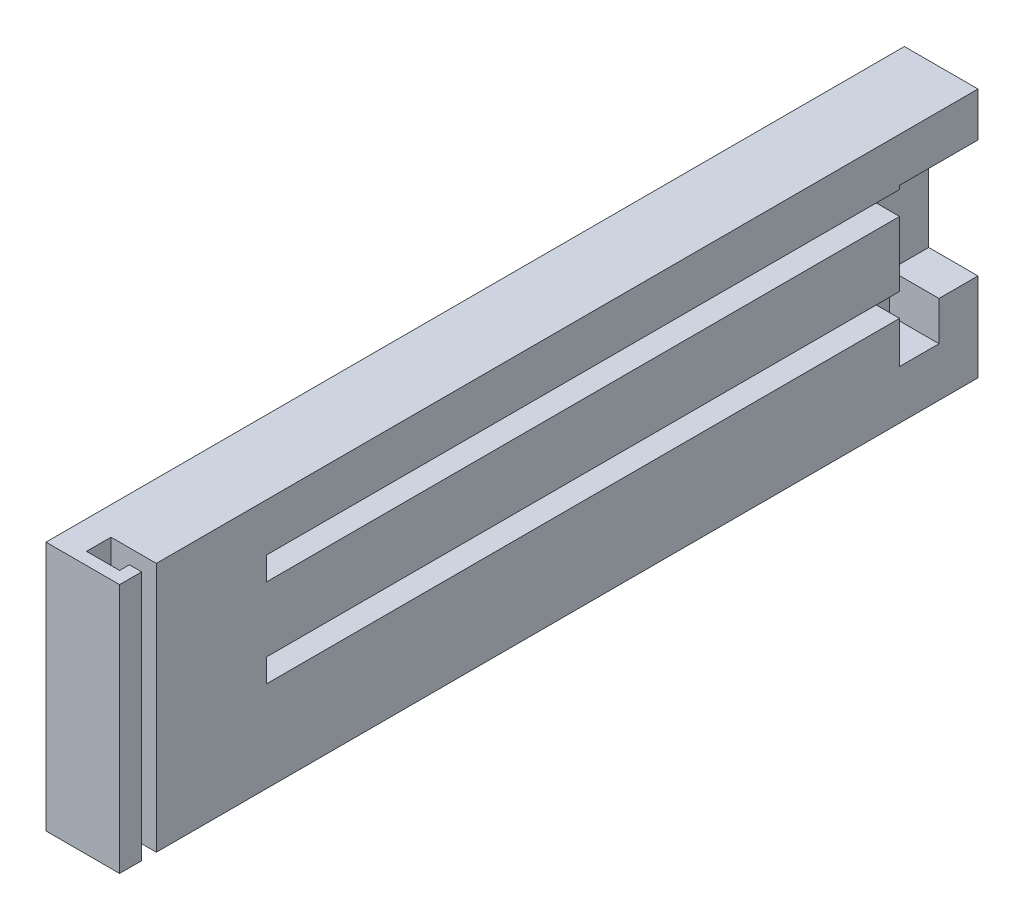
ISO-10303-21;
HEADER;
FILE_DESCRIPTION(('STEP AP214'),'2;1');
FILE_NAME('part.step','',(''),(''),'','','');
FILE_SCHEMA(('AUTOMOTIVE_DESIGN { 1 0 10303 214 1 1 1 1 }'));
ENDSEC;
DATA;
#1=APPLICATION_CONTEXT('core data for automotive mechanical design processes');
#2=APPLICATION_PROTOCOL_DEFINITION('international standard','automotive_design',2000,#1);
#3=PRODUCT_CONTEXT('',#1,'mechanical');
#4=PRODUCT('Part','Part','',(#3));
#5=PRODUCT_RELATED_PRODUCT_CATEGORY('part','',(#4));
#6=PRODUCT_DEFINITION_FORMATION('','',#4);
#7=PRODUCT_DEFINITION_CONTEXT('part definition',#1,'design');
#8=PRODUCT_DEFINITION('design','',#6,#7);
#9=PRODUCT_DEFINITION_SHAPE('','',#8);
#10=(LENGTH_UNIT() NAMED_UNIT(*) SI_UNIT(.MILLI.,.METRE.));
#11=(NAMED_UNIT(*) PLANE_ANGLE_UNIT() SI_UNIT($,.RADIAN.));
#12=(NAMED_UNIT(*) SI_UNIT($,.STERADIAN.) SOLID_ANGLE_UNIT());
#13=UNCERTAINTY_MEASURE_WITH_UNIT(LENGTH_MEASURE(1.E-05),#10,'distance_accuracy_value','');
#14=(GEOMETRIC_REPRESENTATION_CONTEXT(3) GLOBAL_UNCERTAINTY_ASSIGNED_CONTEXT((#13)) GLOBAL_UNIT_ASSIGNED_CONTEXT((#10,
#11,#12)) REPRESENTATION_CONTEXT('',''));
#15=CARTESIAN_POINT('',(0.,0.,0.));
#16=DIRECTION('',(0.,0.,1.));
#17=DIRECTION('',(1.,0.,0.));
#18=AXIS2_PLACEMENT_3D('',#15,#16,#17);
#19=CARTESIAN_POINT('',(15.,0.,0.));
#20=DIRECTION('',(-1.,0.,0.));
#21=DIRECTION('',(0.,0.,1.));
#22=AXIS2_PLACEMENT_3D('',#19,#20,#21);
#23=PLANE('',#22);
#24=DIRECTION('',(0.,0.,-1.));
#25=VECTOR('',#24,1.);
#26=CARTESIAN_POINT('',(15.,-10.4427333974976,-94.4379210779596));
#27=LINE('',#26,#25);
#28=CARTESIAN_POINT('',(15.,-10.4427333974976,-94.4379210779596));
#29=VERTEX_POINT('',#28);
#30=CARTESIAN_POINT('',(15.,-10.4427333974976,-102.48792107796));
#31=VERTEX_POINT('',#30);
#32=EDGE_CURVE('E218',#29,#31,#27,.T.);
#33=ORIENTED_EDGE('',*,*,#32,.F.);
#34=DIRECTION('',(0.,-1.,0.));
#35=VECTOR('',#34,1.);
#36=CARTESIAN_POINT('',(15.,0.,-94.4379210779596));
#37=LINE('',#36,#35);
#38=CARTESIAN_POINT('',(15.,-1.9427333974976,-94.4379210779596));
#39=VERTEX_POINT('',#38);
#40=EDGE_CURVE('E272',#39,#29,#37,.T.);
#41=ORIENTED_EDGE('',*,*,#40,.F.);
#42=DIRECTION('',(0.,0.,-1.));
#43=VECTOR('',#42,1.);
#44=CARTESIAN_POINT('',(15.,-1.94273339749751,34.5620789220404));
#45=LINE('',#44,#43);
#46=CARTESIAN_POINT('',(15.,-1.94273339749751,34.5620789220404));
#47=VERTEX_POINT('',#46);
#48=EDGE_CURVE('E314',#47,#39,#45,.T.);
#49=ORIENTED_EDGE('',*,*,#48,.F.);
#50=DIRECTION('',(0.,-1.,0.));
#51=VECTOR('',#50,1.);
#52=CARTESIAN_POINT('',(15.,0.,34.5620789220404));
#53=LINE('',#52,#51);
#54=CARTESIAN_POINT('',(15.,2.80726660250249,34.5620789220404));
#55=VERTEX_POINT('',#54);
#56=EDGE_CURVE('E309',#55,#47,#53,.T.);
#57=ORIENTED_EDGE('',*,*,#56,.F.);
#58=DIRECTION('',(0.,0.,-1.));
#59=VECTOR('',#58,1.);
#60=CARTESIAN_POINT('',(15.,2.80726660250249,34.5620789220404));
#61=LINE('',#60,#59);
#62=CARTESIAN_POINT('',(15.,2.8072666025024,-94.4379210779596));
#63=VERTEX_POINT('',#62);
#64=EDGE_CURVE('E319',#55,#63,#61,.T.);
#65=ORIENTED_EDGE('',*,*,#64,.T.);
#66=DIRECTION('',(0.,-1.,0.));
#67=VECTOR('',#66,1.);
#68=CARTESIAN_POINT('',(15.,0.,-94.4379210779596));
#69=LINE('',#68,#67);
#70=CARTESIAN_POINT('',(15.,16.0572666025024,-94.4379210779596));
#71=VERTEX_POINT('',#70);
#72=EDGE_CURVE('E261',#71,#63,#69,.T.);
#73=ORIENTED_EDGE('',*,*,#72,.F.);
#74=DIRECTION('',(0.,0.,-1.));
#75=VECTOR('',#74,1.);
#76=CARTESIAN_POINT('',(15.,16.0572666025025,34.5620789220404));
#77=LINE('',#76,#75);
#78=CARTESIAN_POINT('',(15.,16.0572666025025,34.5620789220404));
#79=VERTEX_POINT('',#78);
#80=EDGE_CURVE('E337',#79,#71,#77,.T.);
#81=ORIENTED_EDGE('',*,*,#80,.F.);
#82=DIRECTION('',(0.,1.,0.));
#83=VECTOR('',#82,1.);
#84=CARTESIAN_POINT('',(15.,16.0572666025025,34.5620789220404));
#85=LINE('',#84,#83);
#86=CARTESIAN_POINT('',(15.,20.8072666025025,34.5620789220404));
#87=VERTEX_POINT('',#86);
#88=EDGE_CURVE('E345',#79,#87,#85,.T.);
#89=ORIENTED_EDGE('',*,*,#88,.T.);
#90=DIRECTION('',(0.,0.,-1.));
#91=VECTOR('',#90,1.);
#92=CARTESIAN_POINT('',(15.,20.8072666025025,34.5620789220404));
#93=LINE('',#92,#91);
#94=CARTESIAN_POINT('',(15.,20.8072666025024,-94.4379210779596));
#95=VERTEX_POINT('',#94);
#96=EDGE_CURVE('E341',#87,#95,#93,.T.);
#97=ORIENTED_EDGE('',*,*,#96,.T.);
#98=DIRECTION('',(0.,-1.,0.));
#99=VECTOR('',#98,1.);
#100=CARTESIAN_POINT('',(15.,0.,-94.4379210779596));
#101=LINE('',#100,#99);
#102=CARTESIAN_POINT('',(15.,21.5572666025024,-94.4379210779596));
#103=VERTEX_POINT('',#102);
#104=EDGE_CURVE('E249',#103,#95,#101,.T.);
#105=ORIENTED_EDGE('',*,*,#104,.F.);
#106=DIRECTION('',(0.,0.,-1.));
#107=VECTOR('',#106,1.);
#108=CARTESIAN_POINT('',(15.,21.5572666025024,-94.4379210779596));
#109=LINE('',#108,#107);
#110=CARTESIAN_POINT('',(15.,21.5572666025024,-110.43792107796));
#111=VERTEX_POINT('',#110);
#112=EDGE_CURVE('E292',#103,#111,#109,.T.);
#113=ORIENTED_EDGE('',*,*,#112,.T.);
#114=DIRECTION('',(0.,-1.,0.));
#115=VECTOR('',#114,1.);
#116=CARTESIAN_POINT('',(15.,30.5572666025024,-110.43792107796));
#117=LINE('',#116,#115);
#118=CARTESIAN_POINT('',(15.,30.5572666025024,-110.43792107796));
#119=VERTEX_POINT('',#118);
#120=EDGE_CURVE('E421',#119,#111,#117,.T.);
#121=ORIENTED_EDGE('',*,*,#120,.F.);
#122=DIRECTION('',(0.,0.,-1.));
#123=VECTOR('',#122,1.);
#124=CARTESIAN_POINT('',(15.,30.5572666025024,64.5620789220404));
#125=LINE('',#124,#123);
#126=CARTESIAN_POINT('',(15.,30.5572666025024,57.0620789220404));
#127=VERTEX_POINT('',#126);
#128=EDGE_CURVE('E420',#127,#119,#125,.T.);
#129=ORIENTED_EDGE('',*,*,#128,.F.);
#130=DIRECTION('',(0.,1.,0.));
#131=VECTOR('',#130,1.);
#132=CARTESIAN_POINT('',(15.,-20.4427333974976,57.0620789220404));
#133=LINE('',#132,#131);
#134=CARTESIAN_POINT('',(15.,-20.4427333974976,57.0620789220404));
#135=VERTEX_POINT('',#134);
#136=EDGE_CURVE('E407',#135,#127,#133,.T.);
#137=ORIENTED_EDGE('',*,*,#136,.F.);
#138=DIRECTION('',(0.,0.,-1.));
#139=VECTOR('',#138,1.);
#140=CARTESIAN_POINT('',(15.,-20.4427333974976,64.5620789220404));
#141=LINE('',#140,#139);
#142=CARTESIAN_POINT('',(15.,-20.4427333974976,-110.43792107796));
#143=VERTEX_POINT('',#142);
#144=EDGE_CURVE('E425',#135,#143,#141,.T.);
#145=ORIENTED_EDGE('',*,*,#144,.T.);
#146=CARTESIAN_POINT('',(15.,-2.4427333974976,-110.43792107796));
#147=VERTEX_POINT('',#146);
#148=EDGE_CURVE('E419',#147,#143,#117,.T.);
#149=ORIENTED_EDGE('',*,*,#148,.F.);
#150=DIRECTION('',(0.,0.,-1.));
#151=VECTOR('',#150,1.);
#152=CARTESIAN_POINT('',(15.,-2.4427333974976,-94.4379210779596));
#153=LINE('',#152,#151);
#154=CARTESIAN_POINT('',(15.,-2.4427333974976,-102.48792107796));
#155=VERTEX_POINT('',#154);
#156=EDGE_CURVE('E232',#155,#147,#153,.T.);
#157=ORIENTED_EDGE('',*,*,#156,.F.);
#158=DIRECTION('',(0.,1.,0.));
#159=VECTOR('',#158,1.);
#160=CARTESIAN_POINT('',(15.,-10.4427333974976,-102.48792107796));
#161=LINE('',#160,#159);
#162=EDGE_CURVE('E210',#31,#155,#161,.T.);
#163=ORIENTED_EDGE('',*,*,#162,.F.);
#164=EDGE_LOOP('',(#33,#41,#49,#57,#65,#73,#81,#89,#97,#105,#113,#121,#129,#137,#145,#149,#157,#163));
#165=FACE_BOUND('',#164,.T.);
#166=ADVANCED_FACE('F43',(#165),#23,.F.);
#167=CARTESIAN_POINT('',(15.,20.8072666025025,34.5620789220404));
#168=DIRECTION('',(0.,-1.,0.));
#169=DIRECTION('',(0.,0.,-1.));
#170=AXIS2_PLACEMENT_3D('',#167,#168,#169);
#171=PLANE('',#170);
#172=DIRECTION('',(0.,0.,-1.));
#173=VECTOR('',#172,1.);
#174=CARTESIAN_POINT('',(10.25,20.8072666025025,34.5620789220404));
#175=LINE('',#174,#173);
#176=CARTESIAN_POINT('',(10.25,20.8072666025025,34.5620789220404));
#177=VERTEX_POINT('',#176);
#178=CARTESIAN_POINT('',(10.25,20.8072666025024,-94.4379210779596));
#179=VERTEX_POINT('',#178);
#180=EDGE_CURVE('E289',#177,#179,#175,.T.);
#181=ORIENTED_EDGE('',*,*,#180,.T.);
#182=DIRECTION('',(-1.,0.,0.));
#183=VECTOR('',#182,1.);
#184=CARTESIAN_POINT('',(0.,20.8072666025024,-94.4379210779596));
#185=LINE('',#184,#183);
#186=EDGE_CURVE('E252',#95,#179,#185,.T.);
#187=ORIENTED_EDGE('',*,*,#186,.F.);
#188=ORIENTED_EDGE('',*,*,#96,.F.);
#189=DIRECTION('',(-1.,0.,0.));
#190=VECTOR('',#189,1.);
#191=CARTESIAN_POINT('',(15.,20.8072666025025,34.5620789220404));
#192=LINE('',#191,#190);
#193=EDGE_CURVE('E302',#87,#177,#192,.T.);
#194=ORIENTED_EDGE('',*,*,#193,.T.);
#195=EDGE_LOOP('',(#181,#187,#188,#194));
#196=FACE_BOUND('',#195,.T.);
#197=ADVANCED_FACE('F509',(#196),#171,.T.);
#198=CARTESIAN_POINT('',(10.25,16.0572666025025,34.5620789220404));
#199=DIRECTION('',(-1.,0.,0.));
#200=DIRECTION('',(0.,0.,1.));
#201=AXIS2_PLACEMENT_3D('',#198,#199,#200);
#202=PLANE('',#201);
#203=DIRECTION('',(0.,-1.,0.));
#204=VECTOR('',#203,1.);
#205=CARTESIAN_POINT('',(10.25,0.,-94.4379210779596));
#206=LINE('',#205,#204);
#207=CARTESIAN_POINT('',(10.25,16.0572666025024,-94.4379210779596));
#208=VERTEX_POINT('',#207);
#209=EDGE_CURVE('E255',#179,#208,#206,.T.);
#210=ORIENTED_EDGE('',*,*,#209,.F.);
#211=ORIENTED_EDGE('',*,*,#180,.F.);
#212=DIRECTION('',(0.,1.,0.));
#213=VECTOR('',#212,1.);
#214=CARTESIAN_POINT('',(10.25,16.0572666025025,34.5620789220404));
#215=LINE('',#214,#213);
#216=CARTESIAN_POINT('',(10.25,16.0572666025025,34.5620789220404));
#217=VERTEX_POINT('',#216);
#218=EDGE_CURVE('E353',#217,#177,#215,.T.);
#219=ORIENTED_EDGE('',*,*,#218,.F.);
#220=DIRECTION('',(0.,0.,-1.));
#221=VECTOR('',#220,1.);
#222=CARTESIAN_POINT('',(10.25,16.0572666025025,34.5620789220404));
#223=LINE('',#222,#221);
#224=EDGE_CURVE('E333',#217,#208,#223,.T.);
#225=ORIENTED_EDGE('',*,*,#224,.T.);
#226=EDGE_LOOP('',(#210,#211,#219,#225));
#227=FACE_BOUND('',#226,.T.);
#228=ADVANCED_FACE('F514',(#227),#202,.F.);
#229=CARTESIAN_POINT('',(15.,16.0572666025025,34.5620789220404));
#230=DIRECTION('',(0.,-1.,0.));
#231=DIRECTION('',(0.,0.,-1.));
#232=AXIS2_PLACEMENT_3D('',#229,#230,#231);
#233=PLANE('',#232);
#234=DIRECTION('',(1.,0.,0.));
#235=VECTOR('',#234,1.);
#236=CARTESIAN_POINT('',(0.,16.0572666025024,-94.4379210779596));
#237=LINE('',#236,#235);
#238=EDGE_CURVE('E258',#208,#71,#237,.T.);
#239=ORIENTED_EDGE('',*,*,#238,.F.);
#240=ORIENTED_EDGE('',*,*,#224,.F.);
#241=DIRECTION('',(-1.,0.,0.));
#242=VECTOR('',#241,1.);
#243=CARTESIAN_POINT('',(15.,16.0572666025025,34.5620789220404));
#244=LINE('',#243,#242);
#245=EDGE_CURVE('E349',#79,#217,#244,.T.);
#246=ORIENTED_EDGE('',*,*,#245,.F.);
#247=ORIENTED_EDGE('',*,*,#80,.T.);
#248=EDGE_LOOP('',(#239,#240,#246,#247));
#249=FACE_BOUND('',#248,.T.);
#250=ADVANCED_FACE('F547',(#249),#233,.F.);
#251=CARTESIAN_POINT('',(0.,-1.94273339749751,34.5620789220404));
#252=DIRECTION('',(0.,1.,0.));
#253=DIRECTION('',(0.,0.,1.));
#254=AXIS2_PLACEMENT_3D('',#251,#252,#253);
#255=PLANE('',#254);
#256=ORIENTED_EDGE('',*,*,#48,.T.);
#257=DIRECTION('',(1.,0.,0.));
#258=VECTOR('',#257,1.);
#259=CARTESIAN_POINT('',(0.,-1.9427333974976,-94.4379210779596));
#260=LINE('',#259,#258);
#261=CARTESIAN_POINT('',(10.25,-1.9427333974976,-94.4379210779596));
#262=VERTEX_POINT('',#261);
#263=EDGE_CURVE('E269',#262,#39,#260,.T.);
#264=ORIENTED_EDGE('',*,*,#263,.F.);
#265=DIRECTION('',(0.,0.,-1.));
#266=VECTOR('',#265,1.);
#267=CARTESIAN_POINT('',(10.25,-1.94273339749751,34.5620789220404));
#268=LINE('',#267,#266);
#269=CARTESIAN_POINT('',(10.25,-1.94273339749751,34.5620789220404));
#270=VERTEX_POINT('',#269);
#271=EDGE_CURVE('E313',#270,#262,#268,.T.);
#272=ORIENTED_EDGE('',*,*,#271,.F.);
#273=DIRECTION('',(1.,0.,0.));
#274=VECTOR('',#273,1.);
#275=CARTESIAN_POINT('',(0.,-1.94273339749751,34.5620789220404));
#276=LINE('',#275,#274);
#277=EDGE_CURVE('E298',#270,#47,#276,.T.);
#278=ORIENTED_EDGE('',*,*,#277,.T.);
#279=EDGE_LOOP('',(#256,#264,#272,#278));
#280=FACE_BOUND('',#279,.T.);
#281=ADVANCED_FACE('F541',(#280),#255,.T.);
#282=CARTESIAN_POINT('',(0.,2.80726660250249,34.5620789220404));
#283=DIRECTION('',(0.,1.,0.));
#284=DIRECTION('',(0.,0.,1.));
#285=AXIS2_PLACEMENT_3D('',#282,#283,#284);
#286=PLANE('',#285);
#287=DIRECTION('',(-1.,0.,0.));
#288=VECTOR('',#287,1.);
#289=CARTESIAN_POINT('',(0.,2.8072666025024,-94.4379210779596));
#290=LINE('',#289,#288);
#291=CARTESIAN_POINT('',(10.25,2.80726660250241,-94.4379210779596));
#292=VERTEX_POINT('',#291);
#293=EDGE_CURVE('E61',#63,#292,#290,.T.);
#294=ORIENTED_EDGE('',*,*,#293,.F.);
#295=ORIENTED_EDGE('',*,*,#64,.F.);
#296=DIRECTION('',(1.,0.,0.));
#297=VECTOR('',#296,1.);
#298=CARTESIAN_POINT('',(0.,2.80726660250249,34.5620789220404));
#299=LINE('',#298,#297);
#300=CARTESIAN_POINT('',(10.25,2.80726660250249,34.5620789220404));
#301=VERTEX_POINT('',#300);
#302=EDGE_CURVE('E305',#301,#55,#299,.T.);
#303=ORIENTED_EDGE('',*,*,#302,.F.);
#304=DIRECTION('',(0.,0.,-1.));
#305=VECTOR('',#304,1.);
#306=CARTESIAN_POINT('',(10.25,2.80726660250249,34.5620789220404));
#307=LINE('',#306,#305);
#308=EDGE_CURVE('E323',#301,#292,#307,.T.);
#309=ORIENTED_EDGE('',*,*,#308,.T.);
#310=EDGE_LOOP('',(#294,#295,#303,#309));
#311=FACE_BOUND('',#310,.T.);
#312=ADVANCED_FACE('F535',(#311),#286,.F.);
#313=CARTESIAN_POINT('',(10.25,0.,34.5620789220404));
#314=DIRECTION('',(1.,0.,0.));
#315=DIRECTION('',(0.,0.,-1.));
#316=AXIS2_PLACEMENT_3D('',#313,#314,#315);
#317=PLANE('',#316);
#318=ORIENTED_EDGE('',*,*,#271,.T.);
#319=DIRECTION('',(0.,-1.,0.));
#320=VECTOR('',#319,1.);
#321=CARTESIAN_POINT('',(10.25,0.,-94.4379210779596));
#322=LINE('',#321,#320);
#323=EDGE_CURVE('E266',#292,#262,#322,.T.);
#324=ORIENTED_EDGE('',*,*,#323,.F.);
#325=ORIENTED_EDGE('',*,*,#308,.F.);
#326=DIRECTION('',(0.,-1.,0.));
#327=VECTOR('',#326,1.);
#328=CARTESIAN_POINT('',(10.25,0.,34.5620789220404));
#329=LINE('',#328,#327);
#330=EDGE_CURVE('E301',#301,#270,#329,.T.);
#331=ORIENTED_EDGE('',*,*,#330,.T.);
#332=EDGE_LOOP('',(#318,#324,#325,#331));
#333=FACE_BOUND('',#332,.T.);
#334=ADVANCED_FACE('F530',(#333),#317,.T.);
#335=CARTESIAN_POINT('',(15.,30.5572666025024,-110.43792107796));
#336=DIRECTION('',(0.,0.,-1.));
#337=DIRECTION('',(-1.,0.,0.));
#338=AXIS2_PLACEMENT_3D('',#335,#336,#337);
#339=PLANE('',#338);
#340=DIRECTION('',(-1.,0.,0.));
#341=VECTOR('',#340,1.);
#342=CARTESIAN_POINT('',(0.,-2.44273339749761,-110.43792107796));
#343=LINE('',#342,#341);
#344=CARTESIAN_POINT('',(4.95,-2.4427333974976,-110.43792107796));
#345=VERTEX_POINT('',#344);
#346=EDGE_CURVE('E246',#147,#345,#343,.T.);
#347=ORIENTED_EDGE('',*,*,#346,.F.);
#348=ORIENTED_EDGE('',*,*,#148,.T.);
#349=DIRECTION('',(-1.,0.,0.));
#350=VECTOR('',#349,1.);
#351=CARTESIAN_POINT('',(15.,-20.4427333974976,-110.43792107796));
#352=LINE('',#351,#350);
#353=CARTESIAN_POINT('',(0.,-20.4427333974976,-110.43792107796));
#354=VERTEX_POINT('',#353);
#355=EDGE_CURVE('E449',#143,#354,#352,.T.);
#356=ORIENTED_EDGE('',*,*,#355,.T.);
#357=DIRECTION('',(0.,-1.,0.));
#358=VECTOR('',#357,1.);
#359=CARTESIAN_POINT('',(0.,30.5572666025024,-110.43792107796));
#360=LINE('',#359,#358);
#361=CARTESIAN_POINT('',(0.,30.5572666025024,-110.43792107796));
#362=VERTEX_POINT('',#361);
#363=EDGE_CURVE('E436',#362,#354,#360,.T.);
#364=ORIENTED_EDGE('',*,*,#363,.F.);
#365=DIRECTION('',(-1.,0.,0.));
#366=VECTOR('',#365,1.);
#367=CARTESIAN_POINT('',(15.,30.5572666025024,-110.43792107796));
#368=LINE('',#367,#366);
#369=EDGE_CURVE('E47',#119,#362,#368,.T.);
#370=ORIENTED_EDGE('',*,*,#369,.F.);
#371=ORIENTED_EDGE('',*,*,#120,.T.);
#372=DIRECTION('',(-1.,0.,0.));
#373=VECTOR('',#372,1.);
#374=CARTESIAN_POINT('',(0.,21.5572666025024,-110.43792107796));
#375=LINE('',#374,#373);
#376=CARTESIAN_POINT('',(4.95,21.5572666025024,-110.43792107796));
#377=VERTEX_POINT('',#376);
#378=EDGE_CURVE('E279',#111,#377,#375,.T.);
#379=ORIENTED_EDGE('',*,*,#378,.T.);
#380=DIRECTION('',(0.,-1.,0.));
#381=VECTOR('',#380,1.);
#382=CARTESIAN_POINT('',(4.95,0.,-110.43792107796));
#383=LINE('',#382,#381);
#384=EDGE_CURVE('E237',#377,#345,#383,.T.);
#385=ORIENTED_EDGE('',*,*,#384,.T.);
#386=EDGE_LOOP('',(#347,#348,#356,#364,#370,#371,#379,#385));
#387=FACE_BOUND('',#386,.T.);
#388=ADVANCED_FACE('F462',(#387),#339,.T.);
#389=CARTESIAN_POINT('',(15.,30.5572666025024,64.5620789220404));
#390=DIRECTION('',(0.,1.,0.));
#391=DIRECTION('',(0.,0.,1.));
#392=AXIS2_PLACEMENT_3D('',#389,#390,#391);
#393=PLANE('',#392);
#394=DIRECTION('',(-1.,0.,0.));
#395=VECTOR('',#394,1.);
#396=CARTESIAN_POINT('',(0.,30.5572666025024,57.0620789220404));
#397=LINE('',#396,#395);
#398=CARTESIAN_POINT('',(5.75,30.5572666025024,57.0620789220404));
#399=VERTEX_POINT('',#398);
#400=EDGE_CURVE('E386',#127,#399,#397,.T.);
#401=ORIENTED_EDGE('',*,*,#400,.F.);
#402=ORIENTED_EDGE('',*,*,#128,.T.);
#403=ORIENTED_EDGE('',*,*,#369,.T.);
#404=DIRECTION('',(0.,0.,-1.));
#405=VECTOR('',#404,1.);
#406=CARTESIAN_POINT('',(0.,30.5572666025024,64.5620789220404));
#407=LINE('',#406,#405);
#408=CARTESIAN_POINT('',(0.,30.5572666025024,64.5620789220404));
#409=VERTEX_POINT('',#408);
#410=EDGE_CURVE('E400',#409,#362,#407,.T.);
#411=ORIENTED_EDGE('',*,*,#410,.F.);
#412=DIRECTION('',(-1.,0.,0.));
#413=VECTOR('',#412,1.);
#414=CARTESIAN_POINT('',(15.,30.5572666025024,64.5620789220404));
#415=LINE('',#414,#413);
#416=CARTESIAN_POINT('',(15.,30.5572666025024,64.5620789220404));
#417=VERTEX_POINT('',#416);
#418=EDGE_CURVE('E11',#417,#409,#415,.T.);
#419=ORIENTED_EDGE('',*,*,#418,.F.);
#420=CARTESIAN_POINT('',(15.,30.5572666025024,60.0620789220404));
#421=VERTEX_POINT('',#420);
#422=EDGE_CURVE('E415',#417,#421,#125,.T.);
#423=ORIENTED_EDGE('',*,*,#422,.T.);
#424=DIRECTION('',(1.,0.,0.));
#425=VECTOR('',#424,1.);
#426=CARTESIAN_POINT('',(0.,30.5572666025024,60.0620789220404));
#427=LINE('',#426,#425);
#428=CARTESIAN_POINT('',(12.5,30.5572666025024,60.0620789220404));
#429=VERTEX_POINT('',#428);
#430=EDGE_CURVE('E69',#429,#421,#427,.T.);
#431=ORIENTED_EDGE('',*,*,#430,.F.);
#432=DIRECTION('',(0.,0.,-1.));
#433=VECTOR('',#432,1.);
#434=CARTESIAN_POINT('',(12.5,30.5572666025024,0.));
#435=LINE('',#434,#433);
#436=CARTESIAN_POINT('',(12.5,30.5572666025024,62.0620789220404));
#437=VERTEX_POINT('',#436);
#438=EDGE_CURVE('E318',#437,#429,#435,.T.);
#439=ORIENTED_EDGE('',*,*,#438,.F.);
#440=DIRECTION('',(1.,0.,0.));
#441=VECTOR('',#440,1.);
#442=CARTESIAN_POINT('',(0.,30.5572666025024,62.0620789220404));
#443=LINE('',#442,#441);
#444=CARTESIAN_POINT('',(5.75,30.5572666025024,62.0620789220404));
#445=VERTEX_POINT('',#444);
#446=EDGE_CURVE('E364',#445,#437,#443,.T.);
#447=ORIENTED_EDGE('',*,*,#446,.F.);
#448=DIRECTION('',(0.,0.,1.));
#449=VECTOR('',#448,1.);
#450=CARTESIAN_POINT('',(5.75,30.5572666025024,0.));
#451=LINE('',#450,#449);
#452=EDGE_CURVE('E390',#399,#445,#451,.T.);
#453=ORIENTED_EDGE('',*,*,#452,.F.);
#454=EDGE_LOOP('',(#401,#402,#403,#411,#419,#423,#431,#439,#447,#453));
#455=FACE_BOUND('',#454,.T.);
#456=ADVANCED_FACE('F45',(#455),#393,.T.);
#457=CARTESIAN_POINT('',(15.,30.5572666025024,64.5620789220404));
#458=DIRECTION('',(0.,0.,-1.));
#459=DIRECTION('',(-1.,0.,0.));
#460=AXIS2_PLACEMENT_3D('',#457,#458,#459);
#461=PLANE('',#460);
#462=DIRECTION('',(0.,-1.,0.));
#463=VECTOR('',#462,1.);
#464=CARTESIAN_POINT('',(0.,30.5572666025024,64.5620789220404));
#465=LINE('',#464,#463);
#466=CARTESIAN_POINT('',(0.,-20.4427333974976,64.5620789220404));
#467=VERTEX_POINT('',#466);
#468=EDGE_CURVE('E444',#409,#467,#465,.T.);
#469=ORIENTED_EDGE('',*,*,#468,.T.);
#470=DIRECTION('',(-1.,0.,0.));
#471=VECTOR('',#470,1.);
#472=CARTESIAN_POINT('',(15.,-20.4427333974976,64.5620789220404));
#473=LINE('',#472,#471);
#474=CARTESIAN_POINT('',(15.,-20.4427333974976,64.5620789220404));
#475=VERTEX_POINT('',#474);
#476=EDGE_CURVE('E53',#475,#467,#473,.T.);
#477=ORIENTED_EDGE('',*,*,#476,.F.);
#478=DIRECTION('',(0.,-1.,0.));
#479=VECTOR('',#478,1.);
#480=CARTESIAN_POINT('',(15.,30.5572666025024,64.5620789220404));
#481=LINE('',#480,#479);
#482=EDGE_CURVE('E430',#417,#475,#481,.T.);
#483=ORIENTED_EDGE('',*,*,#482,.F.);
#484=ORIENTED_EDGE('',*,*,#418,.T.);
#485=EDGE_LOOP('',(#469,#477,#483,#484));
#486=FACE_BOUND('',#485,.T.);
#487=ADVANCED_FACE('F469',(#486),#461,.F.);
#488=CARTESIAN_POINT('',(15.,-20.4427333974976,64.5620789220404));
#489=DIRECTION('',(0.,1.,0.));
#490=DIRECTION('',(0.,0.,1.));
#491=AXIS2_PLACEMENT_3D('',#488,#489,#490);
#492=PLANE('',#491);
#493=ORIENTED_EDGE('',*,*,#144,.F.);
#494=DIRECTION('',(-1.,0.,0.));
#495=VECTOR('',#494,1.);
#496=CARTESIAN_POINT('',(0.,-20.4427333974976,57.0620789220404));
#497=LINE('',#496,#495);
#498=CARTESIAN_POINT('',(5.75,-20.4427333974976,57.0620789220404));
#499=VERTEX_POINT('',#498);
#500=EDGE_CURVE('E368',#135,#499,#497,.T.);
#501=ORIENTED_EDGE('',*,*,#500,.T.);
#502=DIRECTION('',(0.,0.,1.));
#503=VECTOR('',#502,1.);
#504=CARTESIAN_POINT('',(5.75,-20.4427333974976,0.));
#505=LINE('',#504,#503);
#506=CARTESIAN_POINT('',(5.75,-20.4427333974976,62.0620789220404));
#507=VERTEX_POINT('',#506);
#508=EDGE_CURVE('E372',#499,#507,#505,.T.);
#509=ORIENTED_EDGE('',*,*,#508,.T.);
#510=DIRECTION('',(1.,0.,0.));
#511=VECTOR('',#510,1.);
#512=CARTESIAN_POINT('',(0.,-20.4427333974976,62.0620789220404));
#513=LINE('',#512,#511);
#514=CARTESIAN_POINT('',(12.5,-20.4427333974976,62.0620789220404));
#515=VERTEX_POINT('',#514);
#516=EDGE_CURVE('E376',#507,#515,#513,.T.);
#517=ORIENTED_EDGE('',*,*,#516,.T.);
#518=DIRECTION('',(0.,0.,-1.));
#519=VECTOR('',#518,1.);
#520=CARTESIAN_POINT('',(12.5,-20.4427333974976,0.));
#521=LINE('',#520,#519);
#522=CARTESIAN_POINT('',(12.5,-20.4427333974976,60.0620789220404));
#523=VERTEX_POINT('',#522);
#524=EDGE_CURVE('E359',#515,#523,#521,.T.);
#525=ORIENTED_EDGE('',*,*,#524,.T.);
#526=DIRECTION('',(1.,0.,0.));
#527=VECTOR('',#526,1.);
#528=CARTESIAN_POINT('',(0.,-20.4427333974976,60.0620789220404));
#529=LINE('',#528,#527);
#530=CARTESIAN_POINT('',(15.,-20.4427333974976,60.0620789220404));
#531=VERTEX_POINT('',#530);
#532=EDGE_CURVE('E363',#523,#531,#529,.T.);
#533=ORIENTED_EDGE('',*,*,#532,.T.);
#534=EDGE_CURVE('E426',#475,#531,#141,.T.);
#535=ORIENTED_EDGE('',*,*,#534,.F.);
#536=ORIENTED_EDGE('',*,*,#476,.T.);
#537=DIRECTION('',(0.,0.,-1.));
#538=VECTOR('',#537,1.);
#539=CARTESIAN_POINT('',(0.,-20.4427333974976,64.5620789220404));
#540=LINE('',#539,#538);
#541=EDGE_CURVE('E440',#467,#354,#540,.T.);
#542=ORIENTED_EDGE('',*,*,#541,.T.);
#543=ORIENTED_EDGE('',*,*,#355,.F.);
#544=EDGE_LOOP('',(#493,#501,#509,#517,#525,#533,#535,#536,#542,#543));
#545=FACE_BOUND('',#544,.T.);
#546=ADVANCED_FACE('F474',(#545),#492,.F.);
#547=ORIENTED_EDGE('',*,*,#534,.T.);
#548=DIRECTION('',(0.,1.,0.));
#549=VECTOR('',#548,1.);
#550=CARTESIAN_POINT('',(15.,-20.4427333974976,60.0620789220404));
#551=LINE('',#550,#549);
#552=EDGE_CURVE('E410',#531,#421,#551,.T.);
#553=ORIENTED_EDGE('',*,*,#552,.T.);
#554=ORIENTED_EDGE('',*,*,#422,.F.);
#555=ORIENTED_EDGE('',*,*,#482,.T.);
#556=EDGE_LOOP('',(#547,#553,#554,#555));
#557=FACE_BOUND('',#556,.T.);
#558=ADVANCED_FACE('F477',(#557),#23,.F.);
#559=CARTESIAN_POINT('',(0.,0.,0.));
#560=DIRECTION('',(-1.,0.,0.));
#561=DIRECTION('',(0.,0.,1.));
#562=AXIS2_PLACEMENT_3D('',#559,#560,#561);
#563=PLANE('',#562);
#564=ORIENTED_EDGE('',*,*,#410,.T.);
#565=ORIENTED_EDGE('',*,*,#363,.T.);
#566=ORIENTED_EDGE('',*,*,#541,.F.);
#567=ORIENTED_EDGE('',*,*,#468,.F.);
#568=EDGE_LOOP('',(#564,#565,#566,#567));
#569=FACE_BOUND('',#568,.T.);
#570=ADVANCED_FACE('F466',(#569),#563,.T.);
#571=CARTESIAN_POINT('',(12.5,-20.4427333974976,0.));
#572=DIRECTION('',(1.,0.,0.));
#573=DIRECTION('',(0.,0.,-1.));
#574=AXIS2_PLACEMENT_3D('',#571,#572,#573);
#575=PLANE('',#574);
#576=ORIENTED_EDGE('',*,*,#438,.T.);
#577=DIRECTION('',(0.,1.,0.));
#578=VECTOR('',#577,1.);
#579=CARTESIAN_POINT('',(12.5,-20.4427333974976,60.0620789220404));
#580=LINE('',#579,#578);
#581=EDGE_CURVE('E380',#523,#429,#580,.T.);
#582=ORIENTED_EDGE('',*,*,#581,.F.);
#583=ORIENTED_EDGE('',*,*,#524,.F.);
#584=DIRECTION('',(0.,1.,0.));
#585=VECTOR('',#584,1.);
#586=CARTESIAN_POINT('',(12.5,-20.4427333974976,62.0620789220404));
#587=LINE('',#586,#585);
#588=EDGE_CURVE('E397',#515,#437,#587,.T.);
#589=ORIENTED_EDGE('',*,*,#588,.T.);
#590=EDGE_LOOP('',(#576,#582,#583,#589));
#591=FACE_BOUND('',#590,.T.);
#592=ADVANCED_FACE('F483',(#591),#575,.F.);
#593=CARTESIAN_POINT('',(0.,-20.4427333974976,62.0620789220404));
#594=DIRECTION('',(0.,0.,1.));
#595=DIRECTION('',(1.,0.,0.));
#596=AXIS2_PLACEMENT_3D('',#593,#594,#595);
#597=PLANE('',#596);
#598=ORIENTED_EDGE('',*,*,#446,.T.);
#599=ORIENTED_EDGE('',*,*,#588,.F.);
#600=ORIENTED_EDGE('',*,*,#516,.F.);
#601=DIRECTION('',(0.,1.,0.));
#602=VECTOR('',#601,1.);
#603=CARTESIAN_POINT('',(5.75,-20.4427333974976,62.0620789220404));
#604=LINE('',#603,#602);
#605=EDGE_CURVE('E401',#507,#445,#604,.T.);
#606=ORIENTED_EDGE('',*,*,#605,.T.);
#607=EDGE_LOOP('',(#598,#599,#600,#606));
#608=FACE_BOUND('',#607,.T.);
#609=ADVANCED_FACE('F487',(#608),#597,.F.);
#610=CARTESIAN_POINT('',(5.75,-20.4427333974976,0.));
#611=DIRECTION('',(-1.,0.,0.));
#612=DIRECTION('',(0.,0.,1.));
#613=AXIS2_PLACEMENT_3D('',#610,#611,#612);
#614=PLANE('',#613);
#615=ORIENTED_EDGE('',*,*,#452,.T.);
#616=ORIENTED_EDGE('',*,*,#605,.F.);
#617=ORIENTED_EDGE('',*,*,#508,.F.);
#618=DIRECTION('',(0.,1.,0.));
#619=VECTOR('',#618,1.);
#620=CARTESIAN_POINT('',(5.75,-20.4427333974976,57.0620789220404));
#621=LINE('',#620,#619);
#622=EDGE_CURVE('E404',#499,#399,#621,.T.);
#623=ORIENTED_EDGE('',*,*,#622,.T.);
#624=EDGE_LOOP('',(#615,#616,#617,#623));
#625=FACE_BOUND('',#624,.T.);
#626=ADVANCED_FACE('F490',(#625),#614,.F.);
#627=CARTESIAN_POINT('',(0.,-20.4427333974976,57.0620789220404));
#628=DIRECTION('',(0.,0.,-1.));
#629=DIRECTION('',(-1.,0.,0.));
#630=AXIS2_PLACEMENT_3D('',#627,#628,#629);
#631=PLANE('',#630);
#632=ORIENTED_EDGE('',*,*,#400,.T.);
#633=ORIENTED_EDGE('',*,*,#622,.F.);
#634=ORIENTED_EDGE('',*,*,#500,.F.);
#635=ORIENTED_EDGE('',*,*,#136,.T.);
#636=EDGE_LOOP('',(#632,#633,#634,#635));
#637=FACE_BOUND('',#636,.T.);
#638=ADVANCED_FACE('F497',(#637),#631,.F.);
#639=CARTESIAN_POINT('',(0.,-20.4427333974976,60.0620789220404));
#640=DIRECTION('',(0.,0.,1.));
#641=DIRECTION('',(1.,0.,0.));
#642=AXIS2_PLACEMENT_3D('',#639,#640,#641);
#643=PLANE('',#642);
#644=ORIENTED_EDGE('',*,*,#430,.T.);
#645=ORIENTED_EDGE('',*,*,#552,.F.);
#646=ORIENTED_EDGE('',*,*,#532,.F.);
#647=ORIENTED_EDGE('',*,*,#581,.T.);
#648=EDGE_LOOP('',(#644,#645,#646,#647));
#649=FACE_BOUND('',#648,.T.);
#650=ADVANCED_FACE('F499',(#649),#643,.F.);
#651=CARTESIAN_POINT('',(0.,0.,34.5620789220404));
#652=DIRECTION('',(0.,0.,-1.));
#653=DIRECTION('',(-1.,0.,0.));
#654=AXIS2_PLACEMENT_3D('',#651,#652,#653);
#655=PLANE('',#654);
#656=ORIENTED_EDGE('',*,*,#193,.F.);
#657=ORIENTED_EDGE('',*,*,#88,.F.);
#658=ORIENTED_EDGE('',*,*,#245,.T.);
#659=ORIENTED_EDGE('',*,*,#218,.T.);
#660=EDGE_LOOP('',(#656,#657,#658,#659));
#661=FACE_BOUND('',#660,.T.);
#662=ADVANCED_FACE('F505',(#661),#655,.T.);
#663=CARTESIAN_POINT('',(0.,0.,34.5620789220404));
#664=DIRECTION('',(0.,0.,-1.));
#665=DIRECTION('',(0.,1.,0.));
#666=AXIS2_PLACEMENT_3D('',#663,#664,#665);
#667=PLANE('',#666);
#668=ORIENTED_EDGE('',*,*,#277,.F.);
#669=ORIENTED_EDGE('',*,*,#330,.F.);
#670=ORIENTED_EDGE('',*,*,#302,.T.);
#671=ORIENTED_EDGE('',*,*,#56,.T.);
#672=EDGE_LOOP('',(#668,#669,#670,#671));
#673=FACE_BOUND('',#672,.T.);
#674=ADVANCED_FACE('F558',(#673),#667,.T.);
#675=CARTESIAN_POINT('',(4.95,0.,-94.4379210779596));
#676=DIRECTION('',(1.,0.,0.));
#677=DIRECTION('',(0.,1.,0.));
#678=AXIS2_PLACEMENT_3D('',#675,#676,#677);
#679=PLANE('',#678);
#680=ORIENTED_EDGE('',*,*,#384,.F.);
#681=DIRECTION('',(0.,0.,-1.));
#682=VECTOR('',#681,1.);
#683=CARTESIAN_POINT('',(4.95,21.5572666025024,-94.4379210779596));
#684=LINE('',#683,#682);
#685=CARTESIAN_POINT('',(4.95,21.5572666025024,-94.4379210779596));
#686=VERTEX_POINT('',#685);
#687=EDGE_CURVE('E275',#686,#377,#684,.T.);
#688=ORIENTED_EDGE('',*,*,#687,.F.);
#689=DIRECTION('',(0.,-1.,0.));
#690=VECTOR('',#689,1.);
#691=CARTESIAN_POINT('',(4.95,0.,-94.4379210779596));
#692=LINE('',#691,#690);
#693=CARTESIAN_POINT('',(4.95,-10.4427333974976,-94.4379210779596));
#694=VERTEX_POINT('',#693);
#695=EDGE_CURVE('E242',#686,#694,#692,.T.);
#696=ORIENTED_EDGE('',*,*,#695,.T.);
#697=DIRECTION('',(0.,0.,1.));
#698=VECTOR('',#697,1.);
#699=CARTESIAN_POINT('',(4.95,-10.4427333974976,-94.4379210779596));
#700=LINE('',#699,#698);
#701=CARTESIAN_POINT('',(4.95,-10.4427333974976,-102.48792107796));
#702=VERTEX_POINT('',#701);
#703=EDGE_CURVE('E217',#702,#694,#700,.T.);
#704=ORIENTED_EDGE('',*,*,#703,.F.);
#705=DIRECTION('',(0.,1.,0.));
#706=VECTOR('',#705,1.);
#707=CARTESIAN_POINT('',(4.95,-10.4427333974976,-102.48792107796));
#708=LINE('',#707,#706);
#709=CARTESIAN_POINT('',(4.95,-2.4427333974976,-102.48792107796));
#710=VERTEX_POINT('',#709);
#711=EDGE_CURVE('E212',#702,#710,#708,.T.);
#712=ORIENTED_EDGE('',*,*,#711,.T.);
#713=DIRECTION('',(0.,0.,-1.));
#714=VECTOR('',#713,1.);
#715=CARTESIAN_POINT('',(4.95,-2.4427333974976,-94.4379210779596));
#716=LINE('',#715,#714);
#717=EDGE_CURVE('E286',#710,#345,#716,.T.);
#718=ORIENTED_EDGE('',*,*,#717,.T.);
#719=EDGE_LOOP('',(#680,#688,#696,#704,#712,#718));
#720=FACE_BOUND('',#719,.T.);
#721=ADVANCED_FACE('F642',(#720),#679,.T.);
#722=CARTESIAN_POINT('',(0.,-2.44273339749761,-94.4379210779596));
#723=DIRECTION('',(0.,-1.,0.));
#724=DIRECTION('',(1.,0.,0.));
#725=AXIS2_PLACEMENT_3D('',#722,#723,#724);
#726=PLANE('',#725);
#727=ORIENTED_EDGE('',*,*,#717,.F.);
#728=DIRECTION('',(-1.,0.,0.));
#729=VECTOR('',#728,1.);
#730=CARTESIAN_POINT('',(15.,-2.4427333974976,-102.48792107796));
#731=LINE('',#730,#729);
#732=EDGE_CURVE('E228',#155,#710,#731,.T.);
#733=ORIENTED_EDGE('',*,*,#732,.F.);
#734=ORIENTED_EDGE('',*,*,#156,.T.);
#735=ORIENTED_EDGE('',*,*,#346,.T.);
#736=EDGE_LOOP('',(#727,#733,#734,#735));
#737=FACE_BOUND('',#736,.T.);
#738=ADVANCED_FACE('F700',(#737),#726,.F.);
#739=CARTESIAN_POINT('',(0.,21.5572666025024,-94.4379210779596));
#740=DIRECTION('',(0.,-1.,0.));
#741=DIRECTION('',(0.,0.,-1.));
#742=AXIS2_PLACEMENT_3D('',#739,#740,#741);
#743=PLANE('',#742);
#744=ORIENTED_EDGE('',*,*,#378,.F.);
#745=ORIENTED_EDGE('',*,*,#112,.F.);
#746=DIRECTION('',(-1.,0.,0.));
#747=VECTOR('',#746,1.);
#748=CARTESIAN_POINT('',(0.,21.5572666025024,-94.4379210779596));
#749=LINE('',#748,#747);
#750=EDGE_CURVE('E245',#103,#686,#749,.T.);
#751=ORIENTED_EDGE('',*,*,#750,.T.);
#752=ORIENTED_EDGE('',*,*,#687,.T.);
#753=EDGE_LOOP('',(#744,#745,#751,#752));
#754=FACE_BOUND('',#753,.T.);
#755=ADVANCED_FACE('F710',(#754),#743,.T.);
#756=CARTESIAN_POINT('',(0.,0.,-94.4379210779596));
#757=DIRECTION('',(0.,0.,-1.));
#758=DIRECTION('',(-1.,0.,0.));
#759=AXIS2_PLACEMENT_3D('',#756,#757,#758);
#760=PLANE('',#759);
#761=ORIENTED_EDGE('',*,*,#695,.F.);
#762=ORIENTED_EDGE('',*,*,#750,.F.);
#763=ORIENTED_EDGE('',*,*,#104,.T.);
#764=ORIENTED_EDGE('',*,*,#186,.T.);
#765=ORIENTED_EDGE('',*,*,#209,.T.);
#766=ORIENTED_EDGE('',*,*,#238,.T.);
#767=ORIENTED_EDGE('',*,*,#72,.T.);
#768=ORIENTED_EDGE('',*,*,#293,.T.);
#769=ORIENTED_EDGE('',*,*,#323,.T.);
#770=ORIENTED_EDGE('',*,*,#263,.T.);
#771=ORIENTED_EDGE('',*,*,#40,.T.);
#772=DIRECTION('',(1.,0.,0.));
#773=VECTOR('',#772,1.);
#774=CARTESIAN_POINT('',(15.,-10.4427333974976,-94.4379210779596));
#775=LINE('',#774,#773);
#776=EDGE_CURVE('E224',#694,#29,#775,.T.);
#777=ORIENTED_EDGE('',*,*,#776,.F.);
#778=EDGE_LOOP('',(#761,#762,#763,#764,#765,#766,#767,#768,#769,#770,#771,#777));
#779=FACE_BOUND('',#778,.T.);
#780=ADVANCED_FACE('F720',(#779),#760,.T.);
#781=CARTESIAN_POINT('',(15.,-10.4427333974976,-102.48792107796));
#782=DIRECTION('',(0.,0.,-1.));
#783=DIRECTION('',(-1.,0.,0.));
#784=AXIS2_PLACEMENT_3D('',#781,#782,#783);
#785=PLANE('',#784);
#786=ORIENTED_EDGE('',*,*,#732,.T.);
#787=ORIENTED_EDGE('',*,*,#711,.F.);
#788=DIRECTION('',(-1.,0.,0.));
#789=VECTOR('',#788,1.);
#790=CARTESIAN_POINT('',(15.,-10.4427333974976,-102.48792107796));
#791=LINE('',#790,#789);
#792=EDGE_CURVE('E205',#31,#702,#791,.T.);
#793=ORIENTED_EDGE('',*,*,#792,.F.);
#794=ORIENTED_EDGE('',*,*,#162,.T.);
#795=EDGE_LOOP('',(#786,#787,#793,#794));
#796=FACE_BOUND('',#795,.T.);
#797=ADVANCED_FACE('F208',(#796),#785,.F.);
#798=CARTESIAN_POINT('',(0.,-10.4427333974976,0.));
#799=DIRECTION('',(0.,1.,0.));
#800=DIRECTION('',(-1.,0.,0.));
#801=AXIS2_PLACEMENT_3D('',#798,#799,#800);
#802=PLANE('',#801);
#803=ORIENTED_EDGE('',*,*,#32,.T.);
#804=ORIENTED_EDGE('',*,*,#792,.T.);
#805=ORIENTED_EDGE('',*,*,#703,.T.);
#806=ORIENTED_EDGE('',*,*,#776,.T.);
#807=EDGE_LOOP('',(#803,#804,#805,#806));
#808=FACE_BOUND('',#807,.T.);
#809=ADVANCED_FACE('F222',(#808),#802,.T.);
#810=CLOSED_SHELL('',(#166,#197,#228,#250,#281,#312,#334,#388,#456,#487,#546,#558,#570,#592,
#609,#626,#638,#650,#662,#674,#721,#738,#755,#780,#797,#809));
#811=MANIFOLD_SOLID_BREP('B2',#810);
#812=ADVANCED_BREP_SHAPE_REPRESENTATION('',(#18,#811),#14);
#813=SHAPE_DEFINITION_REPRESENTATION(#9,#812);
ENDSEC;
END-ISO-10303-21;
